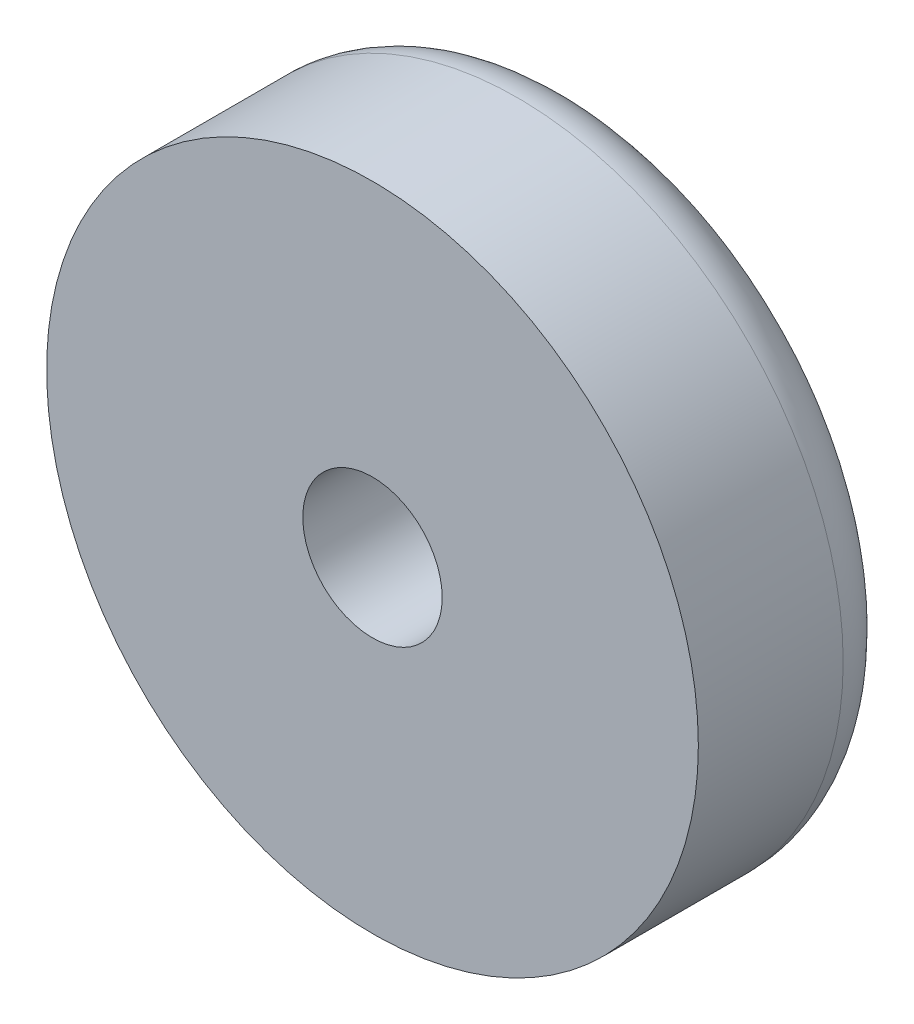
ISO-10303-21;
HEADER;
FILE_DESCRIPTION(('STEP AP214'),'2;1');
FILE_NAME('part.step','',(''),(''),'','','');
FILE_SCHEMA(('AUTOMOTIVE_DESIGN { 1 0 10303 214 1 1 1 1 }'));
ENDSEC;
DATA;
#1=APPLICATION_CONTEXT('core data for automotive mechanical design processes');
#2=APPLICATION_PROTOCOL_DEFINITION('international standard','automotive_design',2000,#1);
#3=PRODUCT_CONTEXT('',#1,'mechanical');
#4=PRODUCT('Part','Part','',(#3));
#5=PRODUCT_RELATED_PRODUCT_CATEGORY('part','',(#4));
#6=PRODUCT_DEFINITION_FORMATION('','',#4);
#7=PRODUCT_DEFINITION_CONTEXT('part definition',#1,'design');
#8=PRODUCT_DEFINITION('design','',#6,#7);
#9=PRODUCT_DEFINITION_SHAPE('','',#8);
#10=(LENGTH_UNIT() NAMED_UNIT(*) SI_UNIT(.MILLI.,.METRE.));
#11=(NAMED_UNIT(*) PLANE_ANGLE_UNIT() SI_UNIT($,.RADIAN.));
#12=(NAMED_UNIT(*) SI_UNIT($,.STERADIAN.) SOLID_ANGLE_UNIT());
#13=UNCERTAINTY_MEASURE_WITH_UNIT(LENGTH_MEASURE(1.E-05),#10,'distance_accuracy_value','');
#14=(GEOMETRIC_REPRESENTATION_CONTEXT(3) GLOBAL_UNCERTAINTY_ASSIGNED_CONTEXT((#13)) GLOBAL_UNIT_ASSIGNED_CONTEXT((#10,
#11,#12)) REPRESENTATION_CONTEXT('',''));
#15=CARTESIAN_POINT('',(0.,0.,0.));
#16=DIRECTION('',(0.,0.,1.));
#17=DIRECTION('',(1.,0.,0.));
#18=AXIS2_PLACEMENT_3D('',#15,#16,#17);
#19=CARTESIAN_POINT('',(0.,0.,6.63995562733809));
#20=DIRECTION('',(0.,0.,1.));
#21=DIRECTION('',(1.,0.,0.));
#22=AXIS2_PLACEMENT_3D('',#19,#20,#21);
#23=SPHERICAL_SURFACE('',#22,10.9);
#24=CARTESIAN_POINT('',(0.,0.,-3.37603159310104));
#25=DIRECTION('',(0.,0.,1.));
#26=DIRECTION('',(1.,0.,0.));
#27=AXIS2_PLACEMENT_3D('',#24,#25,#26);
#28=CIRCLE('',#27,4.3);
#29=CARTESIAN_POINT('',(4.3,0.,-3.37603159310104));
#30=VERTEX_POINT('',#29);
#31=EDGE_CURVE('E10',#30,#30,#28,.T.);
#32=ORIENTED_EDGE('',*,*,#31,.F.);
#33=EDGE_LOOP('',(#32));
#34=FACE_BOUND('',#33,.T.);
#35=ADVANCED_FACE('F43',(#34),#23,.T.);
#36=CARTESIAN_POINT('',(0.,0.,0.));
#37=DIRECTION('',(0.,0.,1.));
#38=DIRECTION('',(1.,0.,0.));
#39=AXIS2_PLACEMENT_3D('',#36,#37,#38);
#40=CYLINDRICAL_SURFACE('',#39,4.3);
#41=ORIENTED_EDGE('',*,*,#31,.T.);
#42=EDGE_LOOP('',(#41));
#43=FACE_BOUND('',#42,.T.);
#44=CARTESIAN_POINT('',(0.,0.,-1.61598722043913));
#45=DIRECTION('',(0.,0.,1.));
#46=DIRECTION('',(1.,0.,0.));
#47=AXIS2_PLACEMENT_3D('',#44,#45,#46);
#48=CIRCLE('',#47,4.3);
#49=CARTESIAN_POINT('',(4.3,0.,-1.61598722043913));
#50=VERTEX_POINT('',#49);
#51=EDGE_CURVE('E50',#50,#50,#48,.T.);
#52=ORIENTED_EDGE('',*,*,#51,.F.);
#53=EDGE_LOOP('',(#52));
#54=FACE_BOUND('',#53,.T.);
#55=ADVANCED_FACE('F119',(#43,#54),#40,.T.);
#56=CARTESIAN_POINT('',(4.3,0.,-1.61598722043913));
#57=DIRECTION('',(0.,0.,-1.));
#58=DIRECTION('',(-1.,0.,0.));
#59=AXIS2_PLACEMENT_3D('',#56,#57,#58);
#60=PLANE('',#59);
#61=ORIENTED_EDGE('',*,*,#51,.T.);
#62=EDGE_LOOP('',(#61));
#63=FACE_BOUND('',#62,.T.);
#64=CARTESIAN_POINT('',(0.,0.,-1.61598722043913));
#65=DIRECTION('',(0.,0.,1.));
#66=DIRECTION('',(1.,0.,0.));
#67=AXIS2_PLACEMENT_3D('',#64,#65,#66);
#68=CIRCLE('',#67,5.);
#69=CARTESIAN_POINT('',(5.,0.,-1.61598722043913));
#70=VERTEX_POINT('',#69);
#71=EDGE_CURVE('E55',#70,#70,#68,.T.);
#72=ORIENTED_EDGE('',*,*,#71,.F.);
#73=EDGE_LOOP('',(#72));
#74=FACE_BOUND('',#73,.T.);
#75=ADVANCED_FACE('F124',(#63,#74),#60,.T.);
#76=CARTESIAN_POINT('',(0.,0.,0.));
#77=DIRECTION('',(0.,0.,1.));
#78=DIRECTION('',(1.,0.,0.));
#79=AXIS2_PLACEMENT_3D('',#76,#77,#78);
#80=CYLINDRICAL_SURFACE('',#79,5.);
#81=ORIENTED_EDGE('',*,*,#71,.T.);
#82=EDGE_LOOP('',(#81));
#83=FACE_BOUND('',#82,.T.);
#84=CARTESIAN_POINT('',(0.,0.,-2.2));
#85=DIRECTION('',(0.,0.,1.));
#86=DIRECTION('',(1.,0.,0.));
#87=AXIS2_PLACEMENT_3D('',#84,#85,#86);
#88=CIRCLE('',#87,5.);
#89=CARTESIAN_POINT('',(5.,0.,-2.2));
#90=VERTEX_POINT('',#89);
#91=EDGE_CURVE('E60',#90,#90,#88,.T.);
#92=ORIENTED_EDGE('',*,*,#91,.F.);
#93=EDGE_LOOP('',(#92));
#94=FACE_BOUND('',#93,.T.);
#95=ADVANCED_FACE('F128',(#83,#94),#80,.F.);
#96=CARTESIAN_POINT('',(5.,0.,-2.2));
#97=DIRECTION('',(0.,0.,-1.));
#98=DIRECTION('',(-1.,0.,0.));
#99=AXIS2_PLACEMENT_3D('',#96,#97,#98);
#100=PLANE('',#99);
#101=ORIENTED_EDGE('',*,*,#91,.T.);
#102=EDGE_LOOP('',(#101));
#103=FACE_BOUND('',#102,.T.);
#104=CARTESIAN_POINT('',(0.,0.,-2.2));
#105=DIRECTION('',(0.,0.,1.));
#106=DIRECTION('',(1.,0.,0.));
#107=AXIS2_PLACEMENT_3D('',#104,#105,#106);
#108=CIRCLE('',#107,11.7);
#109=CARTESIAN_POINT('',(11.7,0.,-2.2));
#110=VERTEX_POINT('',#109);
#111=EDGE_CURVE('E66',#110,#110,#108,.T.);
#112=ORIENTED_EDGE('',*,*,#111,.F.);
#113=EDGE_LOOP('',(#112));
#114=FACE_BOUND('',#113,.T.);
#115=ADVANCED_FACE('F134',(#103,#114),#100,.T.);
#116=CARTESIAN_POINT('',(0.,0.,0.));
#117=DIRECTION('',(0.,0.,1.));
#118=DIRECTION('',(1.,0.,0.));
#119=AXIS2_PLACEMENT_3D('',#116,#117,#118);
#120=CYLINDRICAL_SURFACE('',#119,11.7);
#121=ORIENTED_EDGE('',*,*,#111,.T.);
#122=EDGE_LOOP('',(#121));
#123=FACE_BOUND('',#122,.T.);
#124=CARTESIAN_POINT('',(0.,0.,-1.74));
#125=DIRECTION('',(0.,0.,1.));
#126=DIRECTION('',(1.,0.,0.));
#127=AXIS2_PLACEMENT_3D('',#124,#125,#126);
#128=CIRCLE('',#127,11.7);
#129=CARTESIAN_POINT('',(11.7,0.,-1.74));
#130=VERTEX_POINT('',#129);
#131=EDGE_CURVE('E70',#130,#130,#128,.T.);
#132=ORIENTED_EDGE('',*,*,#131,.F.);
#133=EDGE_LOOP('',(#132));
#134=FACE_BOUND('',#133,.T.);
#135=ADVANCED_FACE('F138',(#123,#134),#120,.T.);
#136=CARTESIAN_POINT('',(11.7,0.,-1.74));
#137=DIRECTION('',(0.,0.,-1.));
#138=DIRECTION('',(-1.,0.,0.));
#139=AXIS2_PLACEMENT_3D('',#136,#137,#138);
#140=PLANE('',#139);
#141=ORIENTED_EDGE('',*,*,#131,.T.);
#142=EDGE_LOOP('',(#141));
#143=FACE_BOUND('',#142,.T.);
#144=CARTESIAN_POINT('',(0.,0.,-1.74));
#145=DIRECTION('',(0.,0.,1.));
#146=DIRECTION('',(1.,0.,0.));
#147=AXIS2_PLACEMENT_3D('',#144,#145,#146);
#148=CIRCLE('',#147,12.2);
#149=CARTESIAN_POINT('',(12.2,0.,-1.74));
#150=VERTEX_POINT('',#149);
#151=EDGE_CURVE('E74',#150,#150,#148,.T.);
#152=ORIENTED_EDGE('',*,*,#151,.F.);
#153=EDGE_LOOP('',(#152));
#154=FACE_BOUND('',#153,.T.);
#155=ADVANCED_FACE('F142',(#143,#154),#140,.T.);
#156=CARTESIAN_POINT('',(0.,0.,0.));
#157=DIRECTION('',(0.,0.,1.));
#158=DIRECTION('',(1.,0.,0.));
#159=AXIS2_PLACEMENT_3D('',#156,#157,#158);
#160=CYLINDRICAL_SURFACE('',#159,12.2);
#161=ORIENTED_EDGE('',*,*,#151,.T.);
#162=EDGE_LOOP('',(#161));
#163=FACE_BOUND('',#162,.T.);
#164=CARTESIAN_POINT('',(0.,0.,-1.86547581061777));
#165=DIRECTION('',(0.,0.,1.));
#166=DIRECTION('',(1.,0.,0.));
#167=AXIS2_PLACEMENT_3D('',#164,#165,#166);
#168=CIRCLE('',#167,12.2);
#169=CARTESIAN_POINT('',(12.2,0.,-1.86547581061777));
#170=VERTEX_POINT('',#169);
#171=EDGE_CURVE('E78',#170,#170,#168,.T.);
#172=ORIENTED_EDGE('',*,*,#171,.F.);
#173=EDGE_LOOP('',(#172));
#174=FACE_BOUND('',#173,.T.);
#175=ADVANCED_FACE('F115',(#163,#174),#160,.F.);
#176=CARTESIAN_POINT('',(0.,0.,0.));
#177=DIRECTION('',(0.,0.,1.));
#178=DIRECTION('',(1.,0.,0.));
#179=AXIS2_PLACEMENT_3D('',#176,#177,#178);
#180=TOROIDAL_SURFACE('',#179,14.8,3.2);
#181=ORIENTED_EDGE('',*,*,#171,.T.);
#182=EDGE_LOOP('',(#181));
#183=FACE_BOUND('',#182,.T.);
#184=CARTESIAN_POINT('',(0.,0.,0.));
#185=DIRECTION('',(0.,0.,1.));
#186=DIRECTION('',(1.,0.,0.));
#187=AXIS2_PLACEMENT_3D('',#184,#185,#186);
#188=CIRCLE('',#187,18.);
#189=CARTESIAN_POINT('',(18.,0.,0.));
#190=VERTEX_POINT('',#189);
#191=EDGE_CURVE('E82',#190,#190,#188,.T.);
#192=ORIENTED_EDGE('',*,*,#191,.F.);
#193=EDGE_LOOP('',(#192));
#194=FACE_BOUND('',#193,.T.);
#195=ADVANCED_FACE('F104',(#183,#194),#180,.T.);
#196=CARTESIAN_POINT('',(0.,0.,8.));
#197=DIRECTION('',(0.,0.,1.));
#198=DIRECTION('',(1.,0.,0.));
#199=AXIS2_PLACEMENT_3D('',#196,#197,#198);
#200=PLANE('',#199);
#201=CARTESIAN_POINT('',(0.,0.,8.));
#202=DIRECTION('',(0.,0.,1.));
#203=DIRECTION('',(1.,0.,0.));
#204=AXIS2_PLACEMENT_3D('',#201,#202,#203);
#205=CIRCLE('',#204,18.);
#206=CARTESIAN_POINT('',(18.,0.,8.));
#207=VERTEX_POINT('',#206);
#208=EDGE_CURVE('E90',#207,#207,#205,.T.);
#209=ORIENTED_EDGE('',*,*,#208,.T.);
#210=EDGE_LOOP('',(#209));
#211=FACE_BOUND('',#210,.T.);
#212=CARTESIAN_POINT('',(0.,0.,8.));
#213=DIRECTION('',(0.,0.,1.));
#214=DIRECTION('',(1.,0.,0.));
#215=AXIS2_PLACEMENT_3D('',#212,#213,#214);
#216=CIRCLE('',#215,3.85);
#217=CARTESIAN_POINT('',(3.85,0.,8.));
#218=VERTEX_POINT('',#217);
#219=EDGE_CURVE('E94',#218,#218,#216,.T.);
#220=ORIENTED_EDGE('',*,*,#219,.F.);
#221=EDGE_LOOP('',(#220));
#222=FACE_BOUND('',#221,.T.);
#223=ADVANCED_FACE('F101',(#211,#222),#200,.T.);
#224=CARTESIAN_POINT('',(0.,0.,8.));
#225=DIRECTION('',(0.,0.,-1.));
#226=DIRECTION('',(-1.,0.,0.));
#227=AXIS2_PLACEMENT_3D('',#224,#225,#226);
#228=CYLINDRICAL_SURFACE('',#227,18.);
#229=ORIENTED_EDGE('',*,*,#208,.F.);
#230=EDGE_LOOP('',(#229));
#231=FACE_BOUND('',#230,.T.);
#232=ORIENTED_EDGE('',*,*,#191,.T.);
#233=EDGE_LOOP('',(#232));
#234=FACE_BOUND('',#233,.T.);
#235=ADVANCED_FACE('F103',(#231,#234),#228,.T.);
#236=CARTESIAN_POINT('',(0.,0.,-3.16004437266191));
#237=DIRECTION('',(0.,0.,1.));
#238=DIRECTION('',(1.,0.,0.));
#239=AXIS2_PLACEMENT_3D('',#236,#237,#238);
#240=PLANE('',#239);
#241=CARTESIAN_POINT('',(0.,0.,-3.16004437266191));
#242=DIRECTION('',(0.,0.,1.));
#243=DIRECTION('',(1.,0.,0.));
#244=AXIS2_PLACEMENT_3D('',#241,#242,#243);
#245=CIRCLE('',#244,3.85);
#246=CARTESIAN_POINT('',(3.85,0.,-3.16004437266191));
#247=VERTEX_POINT('',#246);
#248=EDGE_CURVE('E86',#247,#247,#245,.T.);
#249=ORIENTED_EDGE('',*,*,#248,.T.);
#250=EDGE_LOOP('',(#249));
#251=FACE_BOUND('',#250,.T.);
#252=ADVANCED_FACE('F111',(#251),#240,.T.);
#253=CARTESIAN_POINT('',(0.,0.,0.));
#254=DIRECTION('',(0.,0.,1.));
#255=DIRECTION('',(1.,0.,0.));
#256=AXIS2_PLACEMENT_3D('',#253,#254,#255);
#257=CYLINDRICAL_SURFACE('',#256,3.85);
#258=ORIENTED_EDGE('',*,*,#248,.F.);
#259=EDGE_LOOP('',(#258));
#260=FACE_BOUND('',#259,.T.);
#261=ORIENTED_EDGE('',*,*,#219,.T.);
#262=EDGE_LOOP('',(#261));
#263=FACE_BOUND('',#262,.T.);
#264=ADVANCED_FACE('F99',(#260,#263),#257,.F.);
#265=CLOSED_SHELL('',(#35,#55,#75,#95,#115,#135,#155,#175,#195,#223,#235,#252,#264));
#266=MANIFOLD_SOLID_BREP('B2',#265);
#267=ADVANCED_BREP_SHAPE_REPRESENTATION('',(#18,#266),#14);
#268=SHAPE_DEFINITION_REPRESENTATION(#9,#267);
ENDSEC;
END-ISO-10303-21;
